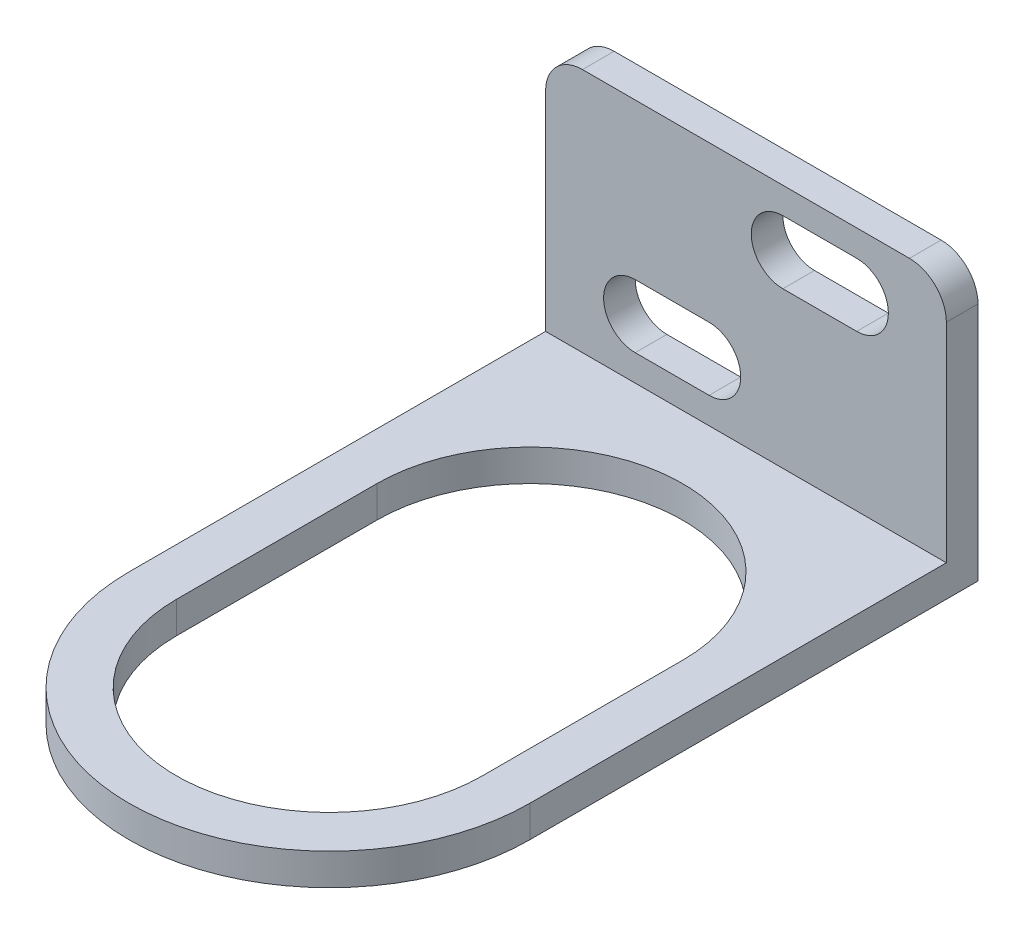
ISO-10303-21;
HEADER;
FILE_DESCRIPTION(('STEP AP214'),'2;1');
FILE_NAME('part.step','',(''),(''),'','','');
FILE_SCHEMA(('AUTOMOTIVE_DESIGN { 1 0 10303 214 1 1 1 1 }'));
ENDSEC;
DATA;
#1=APPLICATION_CONTEXT('core data for automotive mechanical design processes');
#2=APPLICATION_PROTOCOL_DEFINITION('international standard','automotive_design',2000,#1);
#3=PRODUCT_CONTEXT('',#1,'mechanical');
#4=PRODUCT('Part','Part','',(#3));
#5=PRODUCT_RELATED_PRODUCT_CATEGORY('part','',(#4));
#6=PRODUCT_DEFINITION_FORMATION('','',#4);
#7=PRODUCT_DEFINITION_CONTEXT('part definition',#1,'design');
#8=PRODUCT_DEFINITION('design','',#6,#7);
#9=PRODUCT_DEFINITION_SHAPE('','',#8);
#10=(LENGTH_UNIT() NAMED_UNIT(*) SI_UNIT(.MILLI.,.METRE.));
#11=(NAMED_UNIT(*) PLANE_ANGLE_UNIT() SI_UNIT($,.RADIAN.));
#12=(NAMED_UNIT(*) SI_UNIT($,.STERADIAN.) SOLID_ANGLE_UNIT());
#13=UNCERTAINTY_MEASURE_WITH_UNIT(LENGTH_MEASURE(1.E-05),#10,'distance_accuracy_value','');
#14=(GEOMETRIC_REPRESENTATION_CONTEXT(3) GLOBAL_UNCERTAINTY_ASSIGNED_CONTEXT((#13)) GLOBAL_UNIT_ASSIGNED_CONTEXT((#10,
#11,#12)) REPRESENTATION_CONTEXT('',''));
#15=CARTESIAN_POINT('',(0.,0.,0.));
#16=DIRECTION('',(0.,0.,1.));
#17=DIRECTION('',(1.,0.,0.));
#18=AXIS2_PLACEMENT_3D('',#15,#16,#17);
#19=CARTESIAN_POINT('',(-38.,0.,63.));
#20=DIRECTION('',(0.,-1.,0.));
#21=DIRECTION('',(0.,0.,-1.));
#22=AXIS2_PLACEMENT_3D('',#19,#20,#21);
#23=PLANE('',#22);
#24=DIRECTION('',(0.,0.,1.));
#25=VECTOR('',#24,1.);
#26=CARTESIAN_POINT('',(-33.5,0.,0.));
#27=LINE('',#26,#25);
#28=CARTESIAN_POINT('',(-33.5,0.,23.5));
#29=VERTEX_POINT('',#28);
#30=CARTESIAN_POINT('',(-33.5,0.,42.5));
#31=VERTEX_POINT('',#30);
#32=EDGE_CURVE('E347',#29,#31,#27,.T.);
#33=ORIENTED_EDGE('',*,*,#32,.T.);
#34=CARTESIAN_POINT('',(-19.,0.,42.5));
#35=DIRECTION('',(0.,1.,0.));
#36=DIRECTION('',(0.,0.,1.));
#37=AXIS2_PLACEMENT_3D('',#34,#35,#36);
#38=CIRCLE('',#37,14.5);
#39=CARTESIAN_POINT('',(-4.5,0.,42.5));
#40=VERTEX_POINT('',#39);
#41=EDGE_CURVE('E359',#31,#40,#38,.T.);
#42=ORIENTED_EDGE('',*,*,#41,.T.);
#43=DIRECTION('',(0.,0.,1.));
#44=VECTOR('',#43,1.);
#45=CARTESIAN_POINT('',(-4.5,0.,0.));
#46=LINE('',#45,#44);
#47=CARTESIAN_POINT('',(-4.5,0.,23.5));
#48=VERTEX_POINT('',#47);
#49=EDGE_CURVE('E357',#48,#40,#46,.T.);
#50=ORIENTED_EDGE('',*,*,#49,.F.);
#51=CARTESIAN_POINT('',(-19.,0.,23.5));
#52=DIRECTION('',(0.,1.,0.));
#53=DIRECTION('',(0.,0.,1.));
#54=AXIS2_PLACEMENT_3D('',#51,#52,#53);
#55=CIRCLE('',#54,14.5);
#56=EDGE_CURVE('E339',#48,#29,#55,.T.);
#57=ORIENTED_EDGE('',*,*,#56,.T.);
#58=EDGE_LOOP('',(#33,#42,#50,#57));
#59=FACE_BOUND('',#58,.T.);
#60=DIRECTION('',(0.,0.,-1.));
#61=VECTOR('',#60,1.);
#62=CARTESIAN_POINT('',(0.,0.,63.));
#63=LINE('',#62,#61);
#64=CARTESIAN_POINT('',(0.,0.,42.5));
#65=VERTEX_POINT('',#64);
#66=CARTESIAN_POINT('',(0.,0.,0.));
#67=VERTEX_POINT('',#66);
#68=EDGE_CURVE('E205',#65,#67,#63,.T.);
#69=ORIENTED_EDGE('',*,*,#68,.F.);
#70=CARTESIAN_POINT('',(-19.,0.,42.5));
#71=DIRECTION('',(0.,1.,0.));
#72=DIRECTION('',(0.,0.,1.));
#73=AXIS2_PLACEMENT_3D('',#70,#71,#72);
#74=CIRCLE('',#73,19.);
#75=CARTESIAN_POINT('',(-38.,0.,42.5));
#76=VERTEX_POINT('',#75);
#77=EDGE_CURVE('E71',#76,#65,#74,.T.);
#78=ORIENTED_EDGE('',*,*,#77,.F.);
#79=DIRECTION('',(0.,0.,-1.));
#80=VECTOR('',#79,1.);
#81=CARTESIAN_POINT('',(-38.,0.,63.));
#82=LINE('',#81,#80);
#83=CARTESIAN_POINT('',(-38.,0.,0.));
#84=VERTEX_POINT('',#83);
#85=EDGE_CURVE('E203',#76,#84,#82,.T.);
#86=ORIENTED_EDGE('',*,*,#85,.T.);
#87=DIRECTION('',(1.,0.,0.));
#88=VECTOR('',#87,1.);
#89=CARTESIAN_POINT('',(-38.,0.,0.));
#90=LINE('',#89,#88);
#91=EDGE_CURVE('E232',#84,#67,#90,.T.);
#92=ORIENTED_EDGE('',*,*,#91,.T.);
#93=EDGE_LOOP('',(#69,#78,#86,#92));
#94=FACE_BOUND('',#93,.T.);
#95=ADVANCED_FACE('F56',(#59,#94),#23,.T.);
#96=CARTESIAN_POINT('',(-38.,3.,63.));
#97=DIRECTION('',(0.,-1.,0.));
#98=DIRECTION('',(0.,0.,-1.));
#99=AXIS2_PLACEMENT_3D('',#96,#97,#98);
#100=PLANE('',#99);
#101=CARTESIAN_POINT('',(-19.,3.,42.5));
#102=DIRECTION('',(0.,1.,0.));
#103=DIRECTION('',(0.,0.,1.));
#104=AXIS2_PLACEMENT_3D('',#101,#102,#103);
#105=CIRCLE('',#104,14.5);
#106=CARTESIAN_POINT('',(-33.5,3.,42.5));
#107=VERTEX_POINT('',#106);
#108=CARTESIAN_POINT('',(-4.5,3.,42.5));
#109=VERTEX_POINT('',#108);
#110=EDGE_CURVE('E351',#107,#109,#105,.T.);
#111=ORIENTED_EDGE('',*,*,#110,.F.);
#112=DIRECTION('',(0.,0.,1.));
#113=VECTOR('',#112,1.);
#114=CARTESIAN_POINT('',(-33.5,3.,0.));
#115=LINE('',#114,#113);
#116=CARTESIAN_POINT('',(-33.5,3.,23.5));
#117=VERTEX_POINT('',#116);
#118=EDGE_CURVE('E353',#117,#107,#115,.T.);
#119=ORIENTED_EDGE('',*,*,#118,.F.);
#120=CARTESIAN_POINT('',(-19.,3.,23.5));
#121=DIRECTION('',(0.,1.,0.));
#122=DIRECTION('',(0.,0.,1.));
#123=AXIS2_PLACEMENT_3D('',#120,#121,#122);
#124=CIRCLE('',#123,14.5);
#125=CARTESIAN_POINT('',(-4.5,3.,23.5));
#126=VERTEX_POINT('',#125);
#127=EDGE_CURVE('E344',#126,#117,#124,.T.);
#128=ORIENTED_EDGE('',*,*,#127,.F.);
#129=DIRECTION('',(0.,0.,1.));
#130=VECTOR('',#129,1.);
#131=CARTESIAN_POINT('',(-4.5,3.,0.));
#132=LINE('',#131,#130);
#133=EDGE_CURVE('E348',#126,#109,#132,.T.);
#134=ORIENTED_EDGE('',*,*,#133,.T.);
#135=EDGE_LOOP('',(#111,#119,#128,#134));
#136=FACE_BOUND('',#135,.T.);
#137=CARTESIAN_POINT('',(-19.,3.,42.5));
#138=DIRECTION('',(0.,1.,0.));
#139=DIRECTION('',(0.,0.,1.));
#140=AXIS2_PLACEMENT_3D('',#137,#138,#139);
#141=CIRCLE('',#140,19.);
#142=CARTESIAN_POINT('',(-38.,3.,42.5));
#143=VERTEX_POINT('',#142);
#144=CARTESIAN_POINT('',(0.,3.,42.5));
#145=VERTEX_POINT('',#144);
#146=EDGE_CURVE('E194',#143,#145,#141,.T.);
#147=ORIENTED_EDGE('',*,*,#146,.T.);
#148=DIRECTION('',(0.,0.,-1.));
#149=VECTOR('',#148,1.);
#150=CARTESIAN_POINT('',(0.,3.,63.));
#151=LINE('',#150,#149);
#152=CARTESIAN_POINT('',(0.,3.,3.));
#153=VERTEX_POINT('',#152);
#154=EDGE_CURVE('E229',#145,#153,#151,.T.);
#155=ORIENTED_EDGE('',*,*,#154,.T.);
#156=DIRECTION('',(1.,0.,0.));
#157=VECTOR('',#156,1.);
#158=CARTESIAN_POINT('',(-38.,3.,3.));
#159=LINE('',#158,#157);
#160=CARTESIAN_POINT('',(-38.,3.,3.));
#161=VERTEX_POINT('',#160);
#162=EDGE_CURVE('E235',#161,#153,#159,.T.);
#163=ORIENTED_EDGE('',*,*,#162,.F.);
#164=DIRECTION('',(0.,0.,-1.));
#165=VECTOR('',#164,1.);
#166=CARTESIAN_POINT('',(-38.,3.,63.));
#167=LINE('',#166,#165);
#168=EDGE_CURVE('E213',#143,#161,#167,.T.);
#169=ORIENTED_EDGE('',*,*,#168,.F.);
#170=EDGE_LOOP('',(#147,#155,#163,#169));
#171=FACE_BOUND('',#170,.T.);
#172=ADVANCED_FACE('F367',(#136,#171),#100,.F.);
#173=CARTESIAN_POINT('',(-38.,0.,0.));
#174=DIRECTION('',(-1.,0.,0.));
#175=DIRECTION('',(0.,0.,1.));
#176=AXIS2_PLACEMENT_3D('',#173,#174,#175);
#177=PLANE('',#176);
#178=ORIENTED_EDGE('',*,*,#85,.F.);
#179=DIRECTION('',(0.,1.,0.));
#180=VECTOR('',#179,1.);
#181=CARTESIAN_POINT('',(-38.,0.,42.5));
#182=LINE('',#181,#180);
#183=EDGE_CURVE('E191',#76,#143,#182,.T.);
#184=ORIENTED_EDGE('',*,*,#183,.T.);
#185=ORIENTED_EDGE('',*,*,#168,.T.);
#186=DIRECTION('',(0.,1.,0.));
#187=VECTOR('',#186,1.);
#188=CARTESIAN_POINT('',(-38.,0.,3.));
#189=LINE('',#188,#187);
#190=CARTESIAN_POINT('',(-38.,22.75,3.));
#191=VERTEX_POINT('',#190);
#192=EDGE_CURVE('E218',#161,#191,#189,.T.);
#193=ORIENTED_EDGE('',*,*,#192,.T.);
#194=DIRECTION('',(0.,0.,-1.));
#195=VECTOR('',#194,1.);
#196=CARTESIAN_POINT('',(-38.,22.75,0.));
#197=LINE('',#196,#195);
#198=CARTESIAN_POINT('',(-38.,22.75,0.));
#199=VERTEX_POINT('',#198);
#200=EDGE_CURVE('E234',#191,#199,#197,.T.);
#201=ORIENTED_EDGE('',*,*,#200,.T.);
#202=DIRECTION('',(0.,1.,0.));
#203=VECTOR('',#202,1.);
#204=CARTESIAN_POINT('',(-38.,0.,0.));
#205=LINE('',#204,#203);
#206=EDGE_CURVE('E211',#84,#199,#205,.T.);
#207=ORIENTED_EDGE('',*,*,#206,.F.);
#208=EDGE_LOOP('',(#178,#184,#185,#193,#201,#207));
#209=FACE_BOUND('',#208,.T.);
#210=ADVANCED_FACE('F208',(#209),#177,.T.);
#211=CARTESIAN_POINT('',(0.,0.,0.));
#212=DIRECTION('',(-1.,0.,0.));
#213=DIRECTION('',(0.,0.,1.));
#214=AXIS2_PLACEMENT_3D('',#211,#212,#213);
#215=PLANE('',#214);
#216=DIRECTION('',(0.,1.,0.));
#217=VECTOR('',#216,1.);
#218=CARTESIAN_POINT('',(0.,0.,42.5));
#219=LINE('',#218,#217);
#220=EDGE_CURVE('E198',#65,#145,#219,.T.);
#221=ORIENTED_EDGE('',*,*,#220,.F.);
#222=ORIENTED_EDGE('',*,*,#68,.T.);
#223=DIRECTION('',(0.,1.,0.));
#224=VECTOR('',#223,1.);
#225=CARTESIAN_POINT('',(0.,0.,0.));
#226=LINE('',#225,#224);
#227=CARTESIAN_POINT('',(0.,22.75,0.));
#228=VERTEX_POINT('',#227);
#229=EDGE_CURVE('E222',#67,#228,#226,.T.);
#230=ORIENTED_EDGE('',*,*,#229,.T.);
#231=DIRECTION('',(0.,0.,-1.));
#232=VECTOR('',#231,1.);
#233=CARTESIAN_POINT('',(0.,22.75,0.));
#234=LINE('',#233,#232);
#235=CARTESIAN_POINT('',(0.,22.75,3.));
#236=VERTEX_POINT('',#235);
#237=EDGE_CURVE('E251',#228,#236,#234,.F.);
#238=ORIENTED_EDGE('',*,*,#237,.T.);
#239=DIRECTION('',(0.,1.,0.));
#240=VECTOR('',#239,1.);
#241=CARTESIAN_POINT('',(0.,0.,3.));
#242=LINE('',#241,#240);
#243=EDGE_CURVE('E225',#153,#236,#242,.T.);
#244=ORIENTED_EDGE('',*,*,#243,.F.);
#245=ORIENTED_EDGE('',*,*,#154,.F.);
#246=EDGE_LOOP('',(#221,#222,#230,#238,#244,#245));
#247=FACE_BOUND('',#246,.T.);
#248=ADVANCED_FACE('F369',(#247),#215,.F.);
#249=CARTESIAN_POINT('',(-3.5,22.75,3.));
#250=DIRECTION('',(0.,0.,-1.));
#251=DIRECTION('',(-1.,0.,0.));
#252=AXIS2_PLACEMENT_3D('',#249,#250,#251);
#253=CYLINDRICAL_SURFACE('',#252,3.5);
#254=DIRECTION('',(0.,0.,-1.));
#255=VECTOR('',#254,1.);
#256=CARTESIAN_POINT('',(-3.5,26.25,3.));
#257=LINE('',#256,#255);
#258=CARTESIAN_POINT('',(-3.5,26.25,3.));
#259=VERTEX_POINT('',#258);
#260=CARTESIAN_POINT('',(-3.5,26.25,0.));
#261=VERTEX_POINT('',#260);
#262=EDGE_CURVE('E248',#259,#261,#257,.T.);
#263=ORIENTED_EDGE('',*,*,#262,.F.);
#264=CARTESIAN_POINT('',(-3.5,22.75,3.));
#265=DIRECTION('',(0.,0.,-1.));
#266=DIRECTION('',(-1.,0.,0.));
#267=AXIS2_PLACEMENT_3D('',#264,#265,#266);
#268=CIRCLE('',#267,3.5);
#269=EDGE_CURVE('E64',#236,#259,#268,.F.);
#270=ORIENTED_EDGE('',*,*,#269,.F.);
#271=ORIENTED_EDGE('',*,*,#237,.F.);
#272=CARTESIAN_POINT('',(-3.5,22.75,0.));
#273=DIRECTION('',(0.,0.,-1.));
#274=DIRECTION('',(-1.,0.,0.));
#275=AXIS2_PLACEMENT_3D('',#272,#273,#274);
#276=CIRCLE('',#275,3.5);
#277=EDGE_CURVE('E12',#261,#228,#276,.T.);
#278=ORIENTED_EDGE('',*,*,#277,.F.);
#279=EDGE_LOOP('',(#263,#270,#271,#278));
#280=FACE_BOUND('',#279,.T.);
#281=ADVANCED_FACE('F58',(#280),#253,.T.);
#282=CARTESIAN_POINT('',(-34.5,22.75,0.));
#283=DIRECTION('',(0.,0.,1.));
#284=DIRECTION('',(1.,0.,0.));
#285=AXIS2_PLACEMENT_3D('',#282,#283,#284);
#286=CYLINDRICAL_SURFACE('',#285,3.5);
#287=ORIENTED_EDGE('',*,*,#200,.F.);
#288=CARTESIAN_POINT('',(-34.5,22.75,3.));
#289=DIRECTION('',(0.,0.,-1.));
#290=DIRECTION('',(-1.,0.,0.));
#291=AXIS2_PLACEMENT_3D('',#288,#289,#290);
#292=CIRCLE('',#291,3.5);
#293=CARTESIAN_POINT('',(-34.5,26.25,3.));
#294=VERTEX_POINT('',#293);
#295=EDGE_CURVE('E244',#294,#191,#292,.F.);
#296=ORIENTED_EDGE('',*,*,#295,.F.);
#297=DIRECTION('',(0.,0.,-1.));
#298=VECTOR('',#297,1.);
#299=CARTESIAN_POINT('',(-34.5,26.25,0.));
#300=LINE('',#299,#298);
#301=CARTESIAN_POINT('',(-34.5,26.25,0.));
#302=VERTEX_POINT('',#301);
#303=EDGE_CURVE('E241',#302,#294,#300,.F.);
#304=ORIENTED_EDGE('',*,*,#303,.F.);
#305=CARTESIAN_POINT('',(-34.5,22.75,0.));
#306=DIRECTION('',(0.,0.,-1.));
#307=DIRECTION('',(-1.,0.,0.));
#308=AXIS2_PLACEMENT_3D('',#305,#306,#307);
#309=CIRCLE('',#308,3.5);
#310=EDGE_CURVE('E246',#199,#302,#309,.T.);
#311=ORIENTED_EDGE('',*,*,#310,.F.);
#312=EDGE_LOOP('',(#287,#296,#304,#311));
#313=FACE_BOUND('',#312,.T.);
#314=ADVANCED_FACE('F266',(#313),#286,.T.);
#315=CARTESIAN_POINT('',(-38.,0.,0.));
#316=DIRECTION('',(0.,0.,-1.));
#317=DIRECTION('',(-1.,0.,0.));
#318=AXIS2_PLACEMENT_3D('',#315,#316,#317);
#319=PLANE('',#318);
#320=CARTESIAN_POINT('',(-15.5,20.75,0.));
#321=DIRECTION('',(0.,0.,1.));
#322=DIRECTION('',(1.,0.,0.));
#323=AXIS2_PLACEMENT_3D('',#320,#321,#322);
#324=CIRCLE('',#323,3.);
#325=CARTESIAN_POINT('',(-15.5,23.75,0.));
#326=VERTEX_POINT('',#325);
#327=CARTESIAN_POINT('',(-15.5,17.75,0.));
#328=VERTEX_POINT('',#327);
#329=EDGE_CURVE('E316',#326,#328,#324,.T.);
#330=ORIENTED_EDGE('',*,*,#329,.T.);
#331=DIRECTION('',(1.,0.,0.));
#332=VECTOR('',#331,1.);
#333=CARTESIAN_POINT('',(-15.5,17.75,0.));
#334=LINE('',#333,#332);
#335=CARTESIAN_POINT('',(-8.5,17.75,0.));
#336=VERTEX_POINT('',#335);
#337=EDGE_CURVE('E331',#328,#336,#334,.T.);
#338=ORIENTED_EDGE('',*,*,#337,.T.);
#339=CARTESIAN_POINT('',(-8.5,20.75,0.));
#340=DIRECTION('',(0.,0.,1.));
#341=DIRECTION('',(1.,0.,0.));
#342=AXIS2_PLACEMENT_3D('',#339,#340,#341);
#343=CIRCLE('',#342,3.);
#344=CARTESIAN_POINT('',(-8.5,23.75,0.));
#345=VERTEX_POINT('',#344);
#346=EDGE_CURVE('E328',#336,#345,#343,.T.);
#347=ORIENTED_EDGE('',*,*,#346,.T.);
#348=DIRECTION('',(-1.,0.,0.));
#349=VECTOR('',#348,1.);
#350=CARTESIAN_POINT('',(-15.5,23.75,0.));
#351=LINE('',#350,#349);
#352=EDGE_CURVE('E308',#345,#326,#351,.T.);
#353=ORIENTED_EDGE('',*,*,#352,.T.);
#354=EDGE_LOOP('',(#330,#338,#347,#353));
#355=FACE_BOUND('',#354,.T.);
#356=CARTESIAN_POINT('',(-29.5,8.5,0.));
#357=DIRECTION('',(0.,0.,1.));
#358=DIRECTION('',(1.,0.,0.));
#359=AXIS2_PLACEMENT_3D('',#356,#357,#358);
#360=CIRCLE('',#359,3.);
#361=CARTESIAN_POINT('',(-29.5,11.5,0.));
#362=VERTEX_POINT('',#361);
#363=CARTESIAN_POINT('',(-29.5,5.5,0.));
#364=VERTEX_POINT('',#363);
#365=EDGE_CURVE('E284',#362,#364,#360,.T.);
#366=ORIENTED_EDGE('',*,*,#365,.T.);
#367=DIRECTION('',(1.,0.,0.));
#368=VECTOR('',#367,1.);
#369=CARTESIAN_POINT('',(-29.5,5.5,0.));
#370=LINE('',#369,#368);
#371=CARTESIAN_POINT('',(-22.5,5.5,0.));
#372=VERTEX_POINT('',#371);
#373=EDGE_CURVE('E299',#364,#372,#370,.T.);
#374=ORIENTED_EDGE('',*,*,#373,.T.);
#375=CARTESIAN_POINT('',(-22.5,8.5,0.));
#376=DIRECTION('',(0.,0.,1.));
#377=DIRECTION('',(1.,0.,0.));
#378=AXIS2_PLACEMENT_3D('',#375,#376,#377);
#379=CIRCLE('',#378,3.);
#380=CARTESIAN_POINT('',(-22.5,11.5,0.));
#381=VERTEX_POINT('',#380);
#382=EDGE_CURVE('E296',#372,#381,#379,.T.);
#383=ORIENTED_EDGE('',*,*,#382,.T.);
#384=DIRECTION('',(-1.,0.,0.));
#385=VECTOR('',#384,1.);
#386=CARTESIAN_POINT('',(-29.5,11.5,0.));
#387=LINE('',#386,#385);
#388=EDGE_CURVE('E276',#381,#362,#387,.T.);
#389=ORIENTED_EDGE('',*,*,#388,.T.);
#390=EDGE_LOOP('',(#366,#374,#383,#389));
#391=FACE_BOUND('',#390,.T.);
#392=DIRECTION('',(1.,0.,0.));
#393=VECTOR('',#392,1.);
#394=CARTESIAN_POINT('',(-38.,26.25,0.));
#395=LINE('',#394,#393);
#396=EDGE_CURVE('E212',#302,#261,#395,.T.);
#397=ORIENTED_EDGE('',*,*,#396,.T.);
#398=ORIENTED_EDGE('',*,*,#277,.T.);
#399=ORIENTED_EDGE('',*,*,#229,.F.);
#400=ORIENTED_EDGE('',*,*,#91,.F.);
#401=ORIENTED_EDGE('',*,*,#206,.T.);
#402=ORIENTED_EDGE('',*,*,#310,.T.);
#403=EDGE_LOOP('',(#397,#398,#399,#400,#401,#402));
#404=FACE_BOUND('',#403,.T.);
#405=ADVANCED_FACE('F372',(#355,#391,#404),#319,.T.);
#406=CARTESIAN_POINT('',(-38.,0.,3.));
#407=DIRECTION('',(0.,0.,-1.));
#408=DIRECTION('',(-1.,0.,0.));
#409=AXIS2_PLACEMENT_3D('',#406,#407,#408);
#410=PLANE('',#409);
#411=DIRECTION('',(1.,0.,0.));
#412=VECTOR('',#411,1.);
#413=CARTESIAN_POINT('',(-15.5,17.75,3.));
#414=LINE('',#413,#412);
#415=CARTESIAN_POINT('',(-15.5,17.75,3.));
#416=VERTEX_POINT('',#415);
#417=CARTESIAN_POINT('',(-8.5,17.75,3.));
#418=VERTEX_POINT('',#417);
#419=EDGE_CURVE('E320',#416,#418,#414,.T.);
#420=ORIENTED_EDGE('',*,*,#419,.F.);
#421=CARTESIAN_POINT('',(-15.5,20.75,3.));
#422=DIRECTION('',(0.,0.,1.));
#423=DIRECTION('',(1.,0.,0.));
#424=AXIS2_PLACEMENT_3D('',#421,#422,#423);
#425=CIRCLE('',#424,3.);
#426=CARTESIAN_POINT('',(-15.5,23.75,3.));
#427=VERTEX_POINT('',#426);
#428=EDGE_CURVE('E323',#427,#416,#425,.T.);
#429=ORIENTED_EDGE('',*,*,#428,.F.);
#430=DIRECTION('',(-1.,0.,0.));
#431=VECTOR('',#430,1.);
#432=CARTESIAN_POINT('',(-15.5,23.75,3.));
#433=LINE('',#432,#431);
#434=CARTESIAN_POINT('',(-8.5,23.75,3.));
#435=VERTEX_POINT('',#434);
#436=EDGE_CURVE('E313',#435,#427,#433,.T.);
#437=ORIENTED_EDGE('',*,*,#436,.F.);
#438=CARTESIAN_POINT('',(-8.5,20.75,3.));
#439=DIRECTION('',(0.,0.,1.));
#440=DIRECTION('',(1.,0.,0.));
#441=AXIS2_PLACEMENT_3D('',#438,#439,#440);
#442=CIRCLE('',#441,3.);
#443=EDGE_CURVE('E317',#418,#435,#442,.T.);
#444=ORIENTED_EDGE('',*,*,#443,.F.);
#445=EDGE_LOOP('',(#420,#429,#437,#444));
#446=FACE_BOUND('',#445,.T.);
#447=DIRECTION('',(1.,0.,0.));
#448=VECTOR('',#447,1.);
#449=CARTESIAN_POINT('',(-29.5,5.5,3.));
#450=LINE('',#449,#448);
#451=CARTESIAN_POINT('',(-29.5,5.5,3.));
#452=VERTEX_POINT('',#451);
#453=CARTESIAN_POINT('',(-22.5,5.5,3.));
#454=VERTEX_POINT('',#453);
#455=EDGE_CURVE('E288',#452,#454,#450,.T.);
#456=ORIENTED_EDGE('',*,*,#455,.F.);
#457=CARTESIAN_POINT('',(-29.5,8.5,3.));
#458=DIRECTION('',(0.,0.,1.));
#459=DIRECTION('',(1.,0.,0.));
#460=AXIS2_PLACEMENT_3D('',#457,#458,#459);
#461=CIRCLE('',#460,3.);
#462=CARTESIAN_POINT('',(-29.5,11.5,3.));
#463=VERTEX_POINT('',#462);
#464=EDGE_CURVE('E291',#463,#452,#461,.T.);
#465=ORIENTED_EDGE('',*,*,#464,.F.);
#466=DIRECTION('',(-1.,0.,0.));
#467=VECTOR('',#466,1.);
#468=CARTESIAN_POINT('',(-29.5,11.5,3.));
#469=LINE('',#468,#467);
#470=CARTESIAN_POINT('',(-22.5,11.5,3.));
#471=VERTEX_POINT('',#470);
#472=EDGE_CURVE('E281',#471,#463,#469,.T.);
#473=ORIENTED_EDGE('',*,*,#472,.F.);
#474=CARTESIAN_POINT('',(-22.5,8.5,3.));
#475=DIRECTION('',(0.,0.,1.));
#476=DIRECTION('',(1.,0.,0.));
#477=AXIS2_PLACEMENT_3D('',#474,#475,#476);
#478=CIRCLE('',#477,3.);
#479=EDGE_CURVE('E285',#454,#471,#478,.T.);
#480=ORIENTED_EDGE('',*,*,#479,.F.);
#481=EDGE_LOOP('',(#456,#465,#473,#480));
#482=FACE_BOUND('',#481,.T.);
#483=ORIENTED_EDGE('',*,*,#243,.T.);
#484=ORIENTED_EDGE('',*,*,#269,.T.);
#485=DIRECTION('',(1.,0.,0.));
#486=VECTOR('',#485,1.);
#487=CARTESIAN_POINT('',(-38.,26.25,3.));
#488=LINE('',#487,#486);
#489=EDGE_CURVE('E216',#294,#259,#488,.T.);
#490=ORIENTED_EDGE('',*,*,#489,.F.);
#491=ORIENTED_EDGE('',*,*,#295,.T.);
#492=ORIENTED_EDGE('',*,*,#192,.F.);
#493=ORIENTED_EDGE('',*,*,#162,.T.);
#494=EDGE_LOOP('',(#483,#484,#490,#491,#492,#493));
#495=FACE_BOUND('',#494,.T.);
#496=ADVANCED_FACE('F256',(#446,#482,#495),#410,.F.);
#497=CARTESIAN_POINT('',(-38.,26.25,3.));
#498=DIRECTION('',(0.,-1.,0.));
#499=DIRECTION('',(0.,0.,-1.));
#500=AXIS2_PLACEMENT_3D('',#497,#498,#499);
#501=PLANE('',#500);
#502=ORIENTED_EDGE('',*,*,#489,.T.);
#503=ORIENTED_EDGE('',*,*,#262,.T.);
#504=ORIENTED_EDGE('',*,*,#396,.F.);
#505=ORIENTED_EDGE('',*,*,#303,.T.);
#506=EDGE_LOOP('',(#502,#503,#504,#505));
#507=FACE_BOUND('',#506,.T.);
#508=ADVANCED_FACE('F262',(#507),#501,.F.);
#509=CARTESIAN_POINT('',(-29.5,8.5,0.));
#510=DIRECTION('',(0.,0.,1.));
#511=DIRECTION('',(1.,0.,0.));
#512=AXIS2_PLACEMENT_3D('',#509,#510,#511);
#513=CYLINDRICAL_SURFACE('',#512,3.);
#514=ORIENTED_EDGE('',*,*,#464,.T.);
#515=DIRECTION('',(0.,0.,1.));
#516=VECTOR('',#515,1.);
#517=CARTESIAN_POINT('',(-29.5,5.5,0.));
#518=LINE('',#517,#516);
#519=EDGE_CURVE('E272',#364,#452,#518,.T.);
#520=ORIENTED_EDGE('',*,*,#519,.F.);
#521=ORIENTED_EDGE('',*,*,#365,.F.);
#522=DIRECTION('',(0.,0.,1.));
#523=VECTOR('',#522,1.);
#524=CARTESIAN_POINT('',(-29.5,11.5,0.));
#525=LINE('',#524,#523);
#526=EDGE_CURVE('E226',#362,#463,#525,.T.);
#527=ORIENTED_EDGE('',*,*,#526,.T.);
#528=EDGE_LOOP('',(#514,#520,#521,#527));
#529=FACE_BOUND('',#528,.T.);
#530=ADVANCED_FACE('F395',(#529),#513,.F.);
#531=CARTESIAN_POINT('',(-29.5,11.5,0.));
#532=DIRECTION('',(0.,1.,0.));
#533=DIRECTION('',(-1.,0.,0.));
#534=AXIS2_PLACEMENT_3D('',#531,#532,#533);
#535=PLANE('',#534);
#536=ORIENTED_EDGE('',*,*,#472,.T.);
#537=ORIENTED_EDGE('',*,*,#526,.F.);
#538=ORIENTED_EDGE('',*,*,#388,.F.);
#539=DIRECTION('',(0.,0.,1.));
#540=VECTOR('',#539,1.);
#541=CARTESIAN_POINT('',(-22.5,11.5,0.));
#542=LINE('',#541,#540);
#543=EDGE_CURVE('E278',#381,#471,#542,.T.);
#544=ORIENTED_EDGE('',*,*,#543,.T.);
#545=EDGE_LOOP('',(#536,#537,#538,#544));
#546=FACE_BOUND('',#545,.T.);
#547=ADVANCED_FACE('F399',(#546),#535,.F.);
#548=CARTESIAN_POINT('',(-22.5,8.5,0.));
#549=DIRECTION('',(0.,0.,1.));
#550=DIRECTION('',(1.,0.,0.));
#551=AXIS2_PLACEMENT_3D('',#548,#549,#550);
#552=CYLINDRICAL_SURFACE('',#551,3.);
#553=ORIENTED_EDGE('',*,*,#479,.T.);
#554=ORIENTED_EDGE('',*,*,#543,.F.);
#555=ORIENTED_EDGE('',*,*,#382,.F.);
#556=DIRECTION('',(0.,0.,1.));
#557=VECTOR('',#556,1.);
#558=CARTESIAN_POINT('',(-22.5,5.5,0.));
#559=LINE('',#558,#557);
#560=EDGE_CURVE('E275',#372,#454,#559,.T.);
#561=ORIENTED_EDGE('',*,*,#560,.T.);
#562=EDGE_LOOP('',(#553,#554,#555,#561));
#563=FACE_BOUND('',#562,.T.);
#564=ADVANCED_FACE('F405',(#563),#552,.F.);
#565=CARTESIAN_POINT('',(-29.5,5.5,0.));
#566=DIRECTION('',(0.,-1.,0.));
#567=DIRECTION('',(1.,0.,0.));
#568=AXIS2_PLACEMENT_3D('',#565,#566,#567);
#569=PLANE('',#568);
#570=ORIENTED_EDGE('',*,*,#455,.T.);
#571=ORIENTED_EDGE('',*,*,#560,.F.);
#572=ORIENTED_EDGE('',*,*,#373,.F.);
#573=ORIENTED_EDGE('',*,*,#519,.T.);
#574=EDGE_LOOP('',(#570,#571,#572,#573));
#575=FACE_BOUND('',#574,.T.);
#576=ADVANCED_FACE('F409',(#575),#569,.F.);
#577=CARTESIAN_POINT('',(-15.5,20.75,0.));
#578=DIRECTION('',(0.,0.,1.));
#579=DIRECTION('',(1.,0.,0.));
#580=AXIS2_PLACEMENT_3D('',#577,#578,#579);
#581=CYLINDRICAL_SURFACE('',#580,3.);
#582=ORIENTED_EDGE('',*,*,#428,.T.);
#583=DIRECTION('',(0.,0.,1.));
#584=VECTOR('',#583,1.);
#585=CARTESIAN_POINT('',(-15.5,17.75,0.));
#586=LINE('',#585,#584);
#587=EDGE_CURVE('E304',#328,#416,#586,.T.);
#588=ORIENTED_EDGE('',*,*,#587,.F.);
#589=ORIENTED_EDGE('',*,*,#329,.F.);
#590=DIRECTION('',(0.,0.,1.));
#591=VECTOR('',#590,1.);
#592=CARTESIAN_POINT('',(-15.5,23.75,0.));
#593=LINE('',#592,#591);
#594=EDGE_CURVE('E293',#326,#427,#593,.T.);
#595=ORIENTED_EDGE('',*,*,#594,.T.);
#596=EDGE_LOOP('',(#582,#588,#589,#595));
#597=FACE_BOUND('',#596,.T.);
#598=ADVANCED_FACE('F456',(#597),#581,.F.);
#599=CARTESIAN_POINT('',(-15.5,23.75,0.));
#600=DIRECTION('',(0.,1.,0.));
#601=DIRECTION('',(-1.,0.,0.));
#602=AXIS2_PLACEMENT_3D('',#599,#600,#601);
#603=PLANE('',#602);
#604=ORIENTED_EDGE('',*,*,#436,.T.);
#605=ORIENTED_EDGE('',*,*,#594,.F.);
#606=ORIENTED_EDGE('',*,*,#352,.F.);
#607=DIRECTION('',(0.,0.,1.));
#608=VECTOR('',#607,1.);
#609=CARTESIAN_POINT('',(-8.5,23.75,0.));
#610=LINE('',#609,#608);
#611=EDGE_CURVE('E310',#345,#435,#610,.T.);
#612=ORIENTED_EDGE('',*,*,#611,.T.);
#613=EDGE_LOOP('',(#604,#605,#606,#612));
#614=FACE_BOUND('',#613,.T.);
#615=ADVANCED_FACE('F446',(#614),#603,.F.);
#616=CARTESIAN_POINT('',(-8.5,20.75,0.));
#617=DIRECTION('',(0.,0.,1.));
#618=DIRECTION('',(1.,0.,0.));
#619=AXIS2_PLACEMENT_3D('',#616,#617,#618);
#620=CYLINDRICAL_SURFACE('',#619,3.);
#621=ORIENTED_EDGE('',*,*,#443,.T.);
#622=ORIENTED_EDGE('',*,*,#611,.F.);
#623=ORIENTED_EDGE('',*,*,#346,.F.);
#624=DIRECTION('',(0.,0.,1.));
#625=VECTOR('',#624,1.);
#626=CARTESIAN_POINT('',(-8.5,17.75,0.));
#627=LINE('',#626,#625);
#628=EDGE_CURVE('E307',#336,#418,#627,.T.);
#629=ORIENTED_EDGE('',*,*,#628,.T.);
#630=EDGE_LOOP('',(#621,#622,#623,#629));
#631=FACE_BOUND('',#630,.T.);
#632=ADVANCED_FACE('F435',(#631),#620,.F.);
#633=CARTESIAN_POINT('',(-15.5,17.75,0.));
#634=DIRECTION('',(0.,-1.,0.));
#635=DIRECTION('',(0.,0.,-1.));
#636=AXIS2_PLACEMENT_3D('',#633,#634,#635);
#637=PLANE('',#636);
#638=ORIENTED_EDGE('',*,*,#419,.T.);
#639=ORIENTED_EDGE('',*,*,#628,.F.);
#640=ORIENTED_EDGE('',*,*,#337,.F.);
#641=ORIENTED_EDGE('',*,*,#587,.T.);
#642=EDGE_LOOP('',(#638,#639,#640,#641));
#643=FACE_BOUND('',#642,.T.);
#644=ADVANCED_FACE('F430',(#643),#637,.F.);
#645=CARTESIAN_POINT('',(-33.5,0.,0.));
#646=DIRECTION('',(-1.,0.,0.));
#647=DIRECTION('',(0.,0.,1.));
#648=AXIS2_PLACEMENT_3D('',#645,#646,#647);
#649=PLANE('',#648);
#650=ORIENTED_EDGE('',*,*,#118,.T.);
#651=DIRECTION('',(0.,1.,0.));
#652=VECTOR('',#651,1.);
#653=CARTESIAN_POINT('',(-33.5,0.,42.5));
#654=LINE('',#653,#652);
#655=EDGE_CURVE('E336',#31,#107,#654,.T.);
#656=ORIENTED_EDGE('',*,*,#655,.F.);
#657=ORIENTED_EDGE('',*,*,#32,.F.);
#658=DIRECTION('',(0.,1.,0.));
#659=VECTOR('',#658,1.);
#660=CARTESIAN_POINT('',(-33.5,0.,23.5));
#661=LINE('',#660,#659);
#662=EDGE_CURVE('E325',#29,#117,#661,.T.);
#663=ORIENTED_EDGE('',*,*,#662,.T.);
#664=EDGE_LOOP('',(#650,#656,#657,#663));
#665=FACE_BOUND('',#664,.T.);
#666=ADVANCED_FACE('F434',(#665),#649,.F.);
#667=CARTESIAN_POINT('',(-19.,0.,23.5));
#668=DIRECTION('',(0.,1.,0.));
#669=DIRECTION('',(0.,0.,1.));
#670=AXIS2_PLACEMENT_3D('',#667,#668,#669);
#671=CYLINDRICAL_SURFACE('',#670,14.5);
#672=ORIENTED_EDGE('',*,*,#127,.T.);
#673=ORIENTED_EDGE('',*,*,#662,.F.);
#674=ORIENTED_EDGE('',*,*,#56,.F.);
#675=DIRECTION('',(0.,1.,0.));
#676=VECTOR('',#675,1.);
#677=CARTESIAN_POINT('',(-4.5,0.,23.5));
#678=LINE('',#677,#676);
#679=EDGE_CURVE('E341',#48,#126,#678,.T.);
#680=ORIENTED_EDGE('',*,*,#679,.T.);
#681=EDGE_LOOP('',(#672,#673,#674,#680));
#682=FACE_BOUND('',#681,.T.);
#683=ADVANCED_FACE('F532',(#682),#671,.F.);
#684=CARTESIAN_POINT('',(-4.5,0.,0.));
#685=DIRECTION('',(-1.,0.,0.));
#686=DIRECTION('',(0.,0.,1.));
#687=AXIS2_PLACEMENT_3D('',#684,#685,#686);
#688=PLANE('',#687);
#689=ORIENTED_EDGE('',*,*,#133,.F.);
#690=ORIENTED_EDGE('',*,*,#679,.F.);
#691=ORIENTED_EDGE('',*,*,#49,.T.);
#692=DIRECTION('',(0.,1.,0.));
#693=VECTOR('',#692,1.);
#694=CARTESIAN_POINT('',(-4.5,0.,42.5));
#695=LINE('',#694,#693);
#696=EDGE_CURVE('E79',#40,#109,#695,.T.);
#697=ORIENTED_EDGE('',*,*,#696,.T.);
#698=EDGE_LOOP('',(#689,#690,#691,#697));
#699=FACE_BOUND('',#698,.T.);
#700=ADVANCED_FACE('F542',(#699),#688,.T.);
#701=CARTESIAN_POINT('',(-19.,0.,42.5));
#702=DIRECTION('',(0.,1.,0.));
#703=DIRECTION('',(0.,0.,1.));
#704=AXIS2_PLACEMENT_3D('',#701,#702,#703);
#705=CYLINDRICAL_SURFACE('',#704,14.5);
#706=ORIENTED_EDGE('',*,*,#110,.T.);
#707=ORIENTED_EDGE('',*,*,#696,.F.);
#708=ORIENTED_EDGE('',*,*,#41,.F.);
#709=ORIENTED_EDGE('',*,*,#655,.T.);
#710=EDGE_LOOP('',(#706,#707,#708,#709));
#711=FACE_BOUND('',#710,.T.);
#712=ADVANCED_FACE('F552',(#711),#705,.F.);
#713=CARTESIAN_POINT('',(-19.,0.,42.5));
#714=DIRECTION('',(0.,1.,0.));
#715=DIRECTION('',(0.,0.,1.));
#716=AXIS2_PLACEMENT_3D('',#713,#714,#715);
#717=CYLINDRICAL_SURFACE('',#716,19.);
#718=ORIENTED_EDGE('',*,*,#146,.F.);
#719=ORIENTED_EDGE('',*,*,#183,.F.);
#720=ORIENTED_EDGE('',*,*,#77,.T.);
#721=ORIENTED_EDGE('',*,*,#220,.T.);
#722=EDGE_LOOP('',(#718,#719,#720,#721));
#723=FACE_BOUND('',#722,.T.);
#724=ADVANCED_FACE('F192',(#723),#717,.T.);
#725=CLOSED_SHELL('',(#95,#172,#210,#248,#281,#314,#405,#496,#508,#530,#547,#564,#576,#598,#615,
#632,#644,#666,#683,#700,#712,#724));
#726=MANIFOLD_SOLID_BREP('B2',#725);
#727=ADVANCED_BREP_SHAPE_REPRESENTATION('',(#18,#726),#14);
#728=SHAPE_DEFINITION_REPRESENTATION(#9,#727);
ENDSEC;
END-ISO-10303-21;
